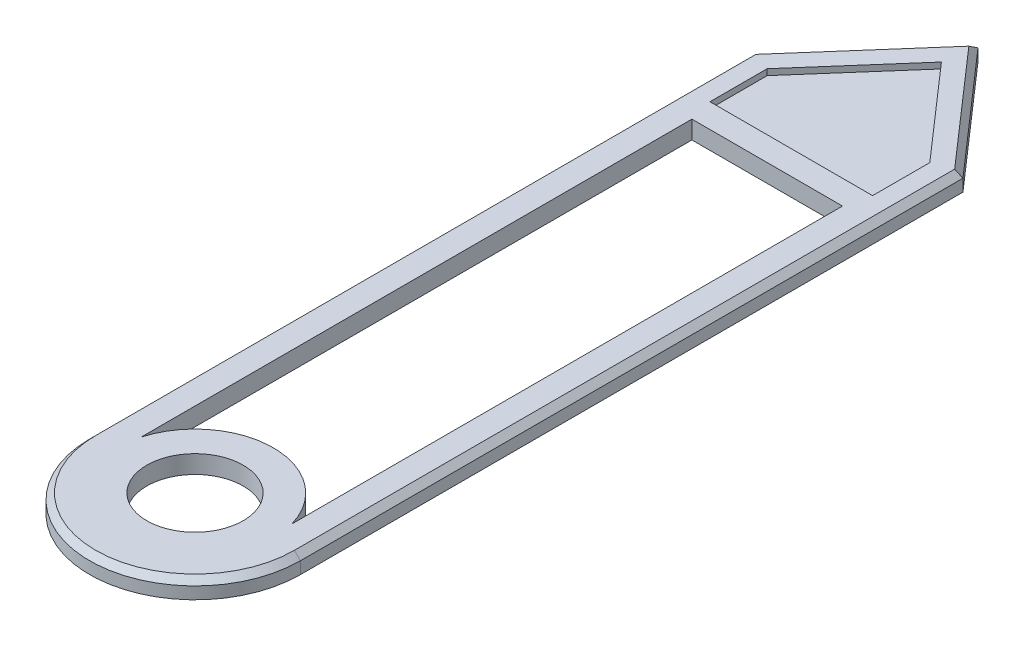
ISO-10303-21;
HEADER;
FILE_DESCRIPTION(('STEP AP214'),'2;1');
FILE_NAME('part.step','',(''),(''),'','','');
FILE_SCHEMA(('AUTOMOTIVE_DESIGN { 1 0 10303 214 1 1 1 1 }'));
ENDSEC;
DATA;
#1=APPLICATION_CONTEXT('core data for automotive mechanical design processes');
#2=APPLICATION_PROTOCOL_DEFINITION('international standard','automotive_design',2000,#1);
#3=PRODUCT_CONTEXT('',#1,'mechanical');
#4=PRODUCT('Part','Part','',(#3));
#5=PRODUCT_RELATED_PRODUCT_CATEGORY('part','',(#4));
#6=PRODUCT_DEFINITION_FORMATION('','',#4);
#7=PRODUCT_DEFINITION_CONTEXT('part definition',#1,'design');
#8=PRODUCT_DEFINITION('design','',#6,#7);
#9=PRODUCT_DEFINITION_SHAPE('','',#8);
#10=(LENGTH_UNIT() NAMED_UNIT(*) SI_UNIT(.MILLI.,.METRE.));
#11=(NAMED_UNIT(*) PLANE_ANGLE_UNIT() SI_UNIT($,.RADIAN.));
#12=(NAMED_UNIT(*) SI_UNIT($,.STERADIAN.) SOLID_ANGLE_UNIT());
#13=UNCERTAINTY_MEASURE_WITH_UNIT(LENGTH_MEASURE(1.E-05),#10,'distance_accuracy_value','');
#14=(GEOMETRIC_REPRESENTATION_CONTEXT(3) GLOBAL_UNCERTAINTY_ASSIGNED_CONTEXT((#13)) GLOBAL_UNIT_ASSIGNED_CONTEXT((#10,
#11,#12)) REPRESENTATION_CONTEXT('',''));
#15=CARTESIAN_POINT('',(0.,0.,0.));
#16=DIRECTION('',(0.,0.,1.));
#17=DIRECTION('',(1.,0.,0.));
#18=AXIS2_PLACEMENT_3D('',#15,#16,#17);
#19=CARTESIAN_POINT('',(0.,0.3,0.));
#20=DIRECTION('',(0.,1.,0.));
#21=DIRECTION('',(0.,0.,1.));
#22=AXIS2_PLACEMENT_3D('',#19,#20,#21);
#23=PLANE('',#22);
#24=DIRECTION('',(-0.658504607868518,0.,0.752576694706878));
#25=VECTOR('',#24,1.);
#26=CARTESIAN_POINT('',(-1.67474233052931,0.3,-10.9341495392131));
#27=LINE('',#26,#25);
#28=CARTESIAN_POINT('',(0.,0.3,-12.8481407741038));
#29=VERTEX_POINT('',#28);
#30=CARTESIAN_POINT('',(-1.65,0.3,-10.9624264883895));
#31=VERTEX_POINT('',#30);
#32=EDGE_CURVE('E346',#29,#31,#27,.T.);
#33=ORIENTED_EDGE('',*,*,#32,.T.);
#34=DIRECTION('',(0.,0.,1.));
#35=VECTOR('',#34,1.);
#36=CARTESIAN_POINT('',(-1.65,0.3,0.));
#37=LINE('',#36,#35);
#38=CARTESIAN_POINT('',(-1.65,0.3,0.));
#39=VERTEX_POINT('',#38);
#40=EDGE_CURVE('E352',#31,#39,#37,.T.);
#41=ORIENTED_EDGE('',*,*,#40,.T.);
#42=CARTESIAN_POINT('',(0.,0.3,0.));
#43=DIRECTION('',(0.,1.,0.));
#44=DIRECTION('',(0.,0.,1.));
#45=AXIS2_PLACEMENT_3D('',#42,#43,#44);
#46=CIRCLE('',#45,1.65);
#47=CARTESIAN_POINT('',(1.65,0.3,0.));
#48=VERTEX_POINT('',#47);
#49=EDGE_CURVE('E349',#39,#48,#46,.T.);
#50=ORIENTED_EDGE('',*,*,#49,.T.);
#51=DIRECTION('',(0.,0.,-1.));
#52=VECTOR('',#51,1.);
#53=CARTESIAN_POINT('',(1.65,0.3,-11.));
#54=LINE('',#53,#52);
#55=CARTESIAN_POINT('',(1.65,0.3,-10.9624264883895));
#56=VERTEX_POINT('',#55);
#57=EDGE_CURVE('E340',#48,#56,#54,.T.);
#58=ORIENTED_EDGE('',*,*,#57,.T.);
#59=DIRECTION('',(-0.658504607868518,0.,-0.752576694706878));
#60=VECTOR('',#59,1.);
#61=CARTESIAN_POINT('',(-0.0752576694706887,0.3,-12.9341495392131));
#62=LINE('',#61,#60);
#63=EDGE_CURVE('E343',#56,#29,#62,.T.);
#64=ORIENTED_EDGE('',*,*,#63,.T.);
#65=EDGE_LOOP('',(#33,#41,#50,#58,#64));
#66=FACE_BOUND('',#65,.T.);
#67=DIRECTION('',(0.,0.,-1.));
#68=VECTOR('',#67,1.);
#69=CARTESIAN_POINT('',(1.35,0.3,-9.9));
#70=LINE('',#69,#68);
#71=CARTESIAN_POINT('',(1.35,0.3,-9.9));
#72=VERTEX_POINT('',#71);
#73=CARTESIAN_POINT('',(1.35,0.3,-10.849705953558));
#74=VERTEX_POINT('',#73);
#75=EDGE_CURVE('E196',#72,#74,#70,.T.);
#76=ORIENTED_EDGE('',*,*,#75,.F.);
#77=DIRECTION('',(1.,0.,0.));
#78=VECTOR('',#77,1.);
#79=CARTESIAN_POINT('',(-1.35,0.3,-9.9));
#80=LINE('',#79,#78);
#81=CARTESIAN_POINT('',(-1.35,0.3,-9.9));
#82=VERTEX_POINT('',#81);
#83=EDGE_CURVE('E217',#82,#72,#80,.T.);
#84=ORIENTED_EDGE('',*,*,#83,.F.);
#85=DIRECTION('',(0.,0.,1.));
#86=VECTOR('',#85,1.);
#87=CARTESIAN_POINT('',(-1.35,0.3,-10.849705953558));
#88=LINE('',#87,#86);
#89=CARTESIAN_POINT('',(-1.35,0.3,-10.849705953558));
#90=VERTEX_POINT('',#89);
#91=EDGE_CURVE('E223',#90,#82,#88,.T.);
#92=ORIENTED_EDGE('',*,*,#91,.F.);
#93=DIRECTION('',(-0.658504607868518,0.,0.752576694706878));
#94=VECTOR('',#93,1.);
#95=CARTESIAN_POINT('',(0.,0.3,-12.3925630964152));
#96=LINE('',#95,#94);
#97=CARTESIAN_POINT('',(0.,0.3,-12.3925630964152));
#98=VERTEX_POINT('',#97);
#99=EDGE_CURVE('E238',#98,#90,#96,.T.);
#100=ORIENTED_EDGE('',*,*,#99,.F.);
#101=DIRECTION('',(-0.658504607868518,0.,-0.752576694706878));
#102=VECTOR('',#101,1.);
#103=CARTESIAN_POINT('',(1.35,0.3,-10.849705953558));
#104=LINE('',#103,#102);
#105=EDGE_CURVE('E235',#74,#98,#104,.T.);
#106=ORIENTED_EDGE('',*,*,#105,.F.);
#107=EDGE_LOOP('',(#76,#84,#92,#100,#106));
#108=FACE_BOUND('',#107,.T.);
#109=CARTESIAN_POINT('',(0.,0.3,0.));
#110=DIRECTION('',(0.,1.,0.));
#111=DIRECTION('',(0.,0.,1.));
#112=AXIS2_PLACEMENT_3D('',#109,#110,#111);
#113=CIRCLE('',#112,0.8);
#114=CARTESIAN_POINT('',(0.,0.3,0.8));
#115=VERTEX_POINT('',#114);
#116=EDGE_CURVE('E298',#115,#115,#113,.T.);
#117=ORIENTED_EDGE('',*,*,#116,.F.);
#118=EDGE_LOOP('',(#117));
#119=FACE_BOUND('',#118,.T.);
#120=DIRECTION('',(0.,0.,-1.));
#121=VECTOR('',#120,1.);
#122=CARTESIAN_POINT('',(1.25,0.3,-9.5));
#123=LINE('',#122,#121);
#124=CARTESIAN_POINT('',(1.25,0.3,-0.357071421427142));
#125=VERTEX_POINT('',#124);
#126=CARTESIAN_POINT('',(1.25,0.3,-9.5));
#127=VERTEX_POINT('',#126);
#128=EDGE_CURVE('E259',#125,#127,#123,.T.);
#129=ORIENTED_EDGE('',*,*,#128,.F.);
#130=CARTESIAN_POINT('',(0.,0.3,0.));
#131=DIRECTION('',(0.,-1.,0.));
#132=DIRECTION('',(0.,0.,-1.));
#133=AXIS2_PLACEMENT_3D('',#130,#131,#132);
#134=CIRCLE('',#133,1.3);
#135=CARTESIAN_POINT('',(-1.25,0.3,-0.357071421427142));
#136=VERTEX_POINT('',#135);
#137=EDGE_CURVE('E256',#136,#125,#134,.T.);
#138=ORIENTED_EDGE('',*,*,#137,.F.);
#139=DIRECTION('',(0.,0.,1.));
#140=VECTOR('',#139,1.);
#141=CARTESIAN_POINT('',(-1.25,0.3,-0.357071421427142));
#142=LINE('',#141,#140);
#143=CARTESIAN_POINT('',(-1.25,0.3,-9.5));
#144=VERTEX_POINT('',#143);
#145=EDGE_CURVE('E267',#144,#136,#142,.T.);
#146=ORIENTED_EDGE('',*,*,#145,.F.);
#147=DIRECTION('',(-1.,0.,0.));
#148=VECTOR('',#147,1.);
#149=CARTESIAN_POINT('',(-1.25,0.3,-9.5));
#150=LINE('',#149,#148);
#151=EDGE_CURVE('E263',#127,#144,#150,.T.);
#152=ORIENTED_EDGE('',*,*,#151,.F.);
#153=EDGE_LOOP('',(#129,#138,#146,#152));
#154=FACE_BOUND('',#153,.T.);
#155=ADVANCED_FACE('F38',(#66,#108,#119,#154),#23,.T.);
#156=CARTESIAN_POINT('',(0.,0.,0.));
#157=DIRECTION('',(0.,1.,0.));
#158=DIRECTION('',(0.,0.,1.));
#159=AXIS2_PLACEMENT_3D('',#156,#157,#158);
#160=PLANE('',#159);
#161=CARTESIAN_POINT('',(0.,0.,0.));
#162=DIRECTION('',(0.,1.,0.));
#163=DIRECTION('',(0.,0.,1.));
#164=AXIS2_PLACEMENT_3D('',#161,#162,#163);
#165=CIRCLE('',#164,0.8);
#166=CARTESIAN_POINT('',(0.,0.,0.8));
#167=VERTEX_POINT('',#166);
#168=EDGE_CURVE('E297',#167,#167,#165,.T.);
#169=ORIENTED_EDGE('',*,*,#168,.T.);
#170=EDGE_LOOP('',(#169));
#171=FACE_BOUND('',#170,.T.);
#172=CARTESIAN_POINT('',(0.,0.,0.));
#173=DIRECTION('',(0.,1.,0.));
#174=DIRECTION('',(0.,0.,1.));
#175=AXIS2_PLACEMENT_3D('',#172,#173,#174);
#176=CIRCLE('',#175,1.75);
#177=CARTESIAN_POINT('',(-1.75,0.,0.));
#178=VERTEX_POINT('',#177);
#179=CARTESIAN_POINT('',(1.75,0.,0.));
#180=VERTEX_POINT('',#179);
#181=EDGE_CURVE('E302',#178,#180,#176,.T.);
#182=ORIENTED_EDGE('',*,*,#181,.F.);
#183=DIRECTION('',(0.,0.,1.));
#184=VECTOR('',#183,1.);
#185=CARTESIAN_POINT('',(-1.75,0.,0.));
#186=LINE('',#185,#184);
#187=CARTESIAN_POINT('',(-1.75,0.,-11.));
#188=VERTEX_POINT('',#187);
#189=EDGE_CURVE('E321',#188,#178,#186,.T.);
#190=ORIENTED_EDGE('',*,*,#189,.F.);
#191=DIRECTION('',(-0.658504607868518,0.,0.752576694706878));
#192=VECTOR('',#191,1.);
#193=CARTESIAN_POINT('',(-1.75,0.,-11.));
#194=LINE('',#193,#192);
#195=CARTESIAN_POINT('',(0.,0.,-13.));
#196=VERTEX_POINT('',#195);
#197=EDGE_CURVE('E317',#196,#188,#194,.T.);
#198=ORIENTED_EDGE('',*,*,#197,.F.);
#199=DIRECTION('',(-0.658504607868518,0.,-0.752576694706878));
#200=VECTOR('',#199,1.);
#201=CARTESIAN_POINT('',(0.,0.,-13.));
#202=LINE('',#201,#200);
#203=CARTESIAN_POINT('',(1.75,0.,-11.));
#204=VERTEX_POINT('',#203);
#205=EDGE_CURVE('E313',#204,#196,#202,.T.);
#206=ORIENTED_EDGE('',*,*,#205,.F.);
#207=DIRECTION('',(0.,0.,-1.));
#208=VECTOR('',#207,1.);
#209=CARTESIAN_POINT('',(1.75,0.,0.));
#210=LINE('',#209,#208);
#211=EDGE_CURVE('E309',#180,#204,#210,.T.);
#212=ORIENTED_EDGE('',*,*,#211,.F.);
#213=EDGE_LOOP('',(#182,#190,#198,#206,#212));
#214=FACE_BOUND('',#213,.T.);
#215=CARTESIAN_POINT('',(0.,0.,0.));
#216=DIRECTION('',(0.,-1.,0.));
#217=DIRECTION('',(0.,0.,-1.));
#218=AXIS2_PLACEMENT_3D('',#215,#216,#217);
#219=CIRCLE('',#218,1.3);
#220=CARTESIAN_POINT('',(-1.25,0.,-0.357071421427142));
#221=VERTEX_POINT('',#220);
#222=CARTESIAN_POINT('',(1.25,0.,-0.357071421427142));
#223=VERTEX_POINT('',#222);
#224=EDGE_CURVE('E247',#221,#223,#219,.T.);
#225=ORIENTED_EDGE('',*,*,#224,.T.);
#226=DIRECTION('',(0.,0.,-1.));
#227=VECTOR('',#226,1.);
#228=CARTESIAN_POINT('',(1.25,0.,-9.5));
#229=LINE('',#228,#227);
#230=CARTESIAN_POINT('',(1.25,0.,-9.5));
#231=VERTEX_POINT('',#230);
#232=EDGE_CURVE('E274',#223,#231,#229,.T.);
#233=ORIENTED_EDGE('',*,*,#232,.T.);
#234=DIRECTION('',(-1.,0.,0.));
#235=VECTOR('',#234,1.);
#236=CARTESIAN_POINT('',(-1.25,0.,-9.5));
#237=LINE('',#236,#235);
#238=CARTESIAN_POINT('',(-1.25,0.,-9.5));
#239=VERTEX_POINT('',#238);
#240=EDGE_CURVE('E278',#231,#239,#237,.T.);
#241=ORIENTED_EDGE('',*,*,#240,.T.);
#242=DIRECTION('',(0.,0.,1.));
#243=VECTOR('',#242,1.);
#244=CARTESIAN_POINT('',(-1.25,0.,-0.357071421427142));
#245=LINE('',#244,#243);
#246=EDGE_CURVE('E260',#239,#221,#245,.T.);
#247=ORIENTED_EDGE('',*,*,#246,.T.);
#248=EDGE_LOOP('',(#225,#233,#241,#247));
#249=FACE_BOUND('',#248,.T.);
#250=ADVANCED_FACE('F421',(#171,#214,#249),#160,.F.);
#251=CARTESIAN_POINT('',(0.,0.3,0.));
#252=DIRECTION('',(0.,-1.,0.));
#253=DIRECTION('',(0.,0.,-1.));
#254=AXIS2_PLACEMENT_3D('',#251,#252,#253);
#255=CYLINDRICAL_SURFACE('',#254,1.75);
#256=DIRECTION('',(0.,-1.,0.));
#257=VECTOR('',#256,1.);
#258=CARTESIAN_POINT('',(1.75,0.3,0.));
#259=LINE('',#258,#257);
#260=CARTESIAN_POINT('',(1.75,0.200000000000001,0.));
#261=VERTEX_POINT('',#260);
#262=EDGE_CURVE('E337',#261,#180,#259,.T.);
#263=ORIENTED_EDGE('',*,*,#262,.F.);
#264=CARTESIAN_POINT('',(0.,0.200000000000001,0.));
#265=DIRECTION('',(0.,1.,0.));
#266=DIRECTION('',(0.,0.,1.));
#267=AXIS2_PLACEMENT_3D('',#264,#265,#266);
#268=CIRCLE('',#267,1.75);
#269=CARTESIAN_POINT('',(-1.75,0.200000000000001,0.));
#270=VERTEX_POINT('',#269);
#271=EDGE_CURVE('E360',#261,#270,#268,.F.);
#272=ORIENTED_EDGE('',*,*,#271,.T.);
#273=DIRECTION('',(0.,-1.,0.));
#274=VECTOR('',#273,1.);
#275=CARTESIAN_POINT('',(-1.75,0.3,0.));
#276=LINE('',#275,#274);
#277=EDGE_CURVE('E325',#270,#178,#276,.T.);
#278=ORIENTED_EDGE('',*,*,#277,.T.);
#279=ORIENTED_EDGE('',*,*,#181,.T.);
#280=EDGE_LOOP('',(#263,#272,#278,#279));
#281=FACE_BOUND('',#280,.T.);
#282=ADVANCED_FACE('F404',(#281),#255,.T.);
#283=CARTESIAN_POINT('',(1.75,0.3,0.));
#284=DIRECTION('',(-1.,0.,0.));
#285=DIRECTION('',(0.,0.,1.));
#286=AXIS2_PLACEMENT_3D('',#283,#284,#285);
#287=PLANE('',#286);
#288=DIRECTION('',(0.,-1.,0.));
#289=VECTOR('',#288,1.);
#290=CARTESIAN_POINT('',(1.75,0.3,-11.));
#291=LINE('',#290,#289);
#292=CARTESIAN_POINT('',(1.75,0.200000000000001,-11.));
#293=VERTEX_POINT('',#292);
#294=EDGE_CURVE('E334',#293,#204,#291,.T.);
#295=ORIENTED_EDGE('',*,*,#294,.F.);
#296=DIRECTION('',(0.,0.,1.));
#297=VECTOR('',#296,1.);
#298=CARTESIAN_POINT('',(1.75,0.200000000000001,0.));
#299=LINE('',#298,#297);
#300=EDGE_CURVE('E11',#293,#261,#299,.T.);
#301=ORIENTED_EDGE('',*,*,#300,.T.);
#302=ORIENTED_EDGE('',*,*,#262,.T.);
#303=ORIENTED_EDGE('',*,*,#211,.T.);
#304=EDGE_LOOP('',(#295,#301,#302,#303));
#305=FACE_BOUND('',#304,.T.);
#306=ADVANCED_FACE('F440',(#305),#287,.F.);
#307=CARTESIAN_POINT('',(0.,0.3,-13.));
#308=DIRECTION('',(-0.752576694706878,0.,0.658504607868518));
#309=DIRECTION('',(0.658504607868518,0.,0.752576694706878));
#310=AXIS2_PLACEMENT_3D('',#307,#308,#309);
#311=PLANE('',#310);
#312=DIRECTION('',(0.,-1.,0.));
#313=VECTOR('',#312,1.);
#314=CARTESIAN_POINT('',(0.,0.3,-13.));
#315=LINE('',#314,#313);
#316=CARTESIAN_POINT('',(0.,0.200000000000001,-13.));
#317=VERTEX_POINT('',#316);
#318=EDGE_CURVE('E331',#317,#196,#315,.T.);
#319=ORIENTED_EDGE('',*,*,#318,.F.);
#320=DIRECTION('',(0.658504607868518,0.,0.752576694706878));
#321=VECTOR('',#320,1.);
#322=CARTESIAN_POINT('',(1.75,0.2,-11.));
#323=LINE('',#322,#321);
#324=EDGE_CURVE('E48',#317,#293,#323,.T.);
#325=ORIENTED_EDGE('',*,*,#324,.T.);
#326=ORIENTED_EDGE('',*,*,#294,.T.);
#327=ORIENTED_EDGE('',*,*,#205,.T.);
#328=EDGE_LOOP('',(#319,#325,#326,#327));
#329=FACE_BOUND('',#328,.T.);
#330=ADVANCED_FACE('F437',(#329),#311,.F.);
#331=CARTESIAN_POINT('',(-1.75,0.3,-11.));
#332=DIRECTION('',(0.752576694706878,0.,0.658504607868518));
#333=DIRECTION('',(0.658504607868518,0.,-0.752576694706878));
#334=AXIS2_PLACEMENT_3D('',#331,#332,#333);
#335=PLANE('',#334);
#336=DIRECTION('',(0.,-1.,0.));
#337=VECTOR('',#336,1.);
#338=CARTESIAN_POINT('',(-1.75,0.3,-11.));
#339=LINE('',#338,#337);
#340=CARTESIAN_POINT('',(-1.75,0.200000000000001,-11.));
#341=VERTEX_POINT('',#340);
#342=EDGE_CURVE('E328',#341,#188,#339,.T.);
#343=ORIENTED_EDGE('',*,*,#342,.F.);
#344=DIRECTION('',(0.658504607868518,0.,-0.752576694706878));
#345=VECTOR('',#344,1.);
#346=CARTESIAN_POINT('',(0.,0.2,-13.));
#347=LINE('',#346,#345);
#348=EDGE_CURVE('E68',#341,#317,#347,.T.);
#349=ORIENTED_EDGE('',*,*,#348,.T.);
#350=ORIENTED_EDGE('',*,*,#318,.T.);
#351=ORIENTED_EDGE('',*,*,#197,.T.);
#352=EDGE_LOOP('',(#343,#349,#350,#351));
#353=FACE_BOUND('',#352,.T.);
#354=ADVANCED_FACE('F434',(#353),#335,.F.);
#355=CARTESIAN_POINT('',(-1.75,0.3,0.));
#356=DIRECTION('',(1.,0.,0.));
#357=DIRECTION('',(0.,0.,-1.));
#358=AXIS2_PLACEMENT_3D('',#355,#356,#357);
#359=PLANE('',#358);
#360=ORIENTED_EDGE('',*,*,#277,.F.);
#361=DIRECTION('',(0.,0.,-1.));
#362=VECTOR('',#361,1.);
#363=CARTESIAN_POINT('',(-1.75,0.200000000000001,-11.));
#364=LINE('',#363,#362);
#365=EDGE_CURVE('E356',#270,#341,#364,.T.);
#366=ORIENTED_EDGE('',*,*,#365,.T.);
#367=ORIENTED_EDGE('',*,*,#342,.T.);
#368=ORIENTED_EDGE('',*,*,#189,.T.);
#369=EDGE_LOOP('',(#360,#366,#367,#368));
#370=FACE_BOUND('',#369,.T.);
#371=ADVANCED_FACE('F407',(#370),#359,.F.);
#372=CARTESIAN_POINT('',(0.,0.3,0.));
#373=DIRECTION('',(0.,-1.,0.));
#374=DIRECTION('',(0.,0.,-1.));
#375=AXIS2_PLACEMENT_3D('',#372,#373,#374);
#376=CYLINDRICAL_SURFACE('',#375,0.8);
#377=ORIENTED_EDGE('',*,*,#116,.T.);
#378=EDGE_LOOP('',(#377));
#379=FACE_BOUND('',#378,.T.);
#380=ORIENTED_EDGE('',*,*,#168,.F.);
#381=EDGE_LOOP('',(#380));
#382=FACE_BOUND('',#381,.T.);
#383=ADVANCED_FACE('F429',(#379,#382),#376,.F.);
#384=CARTESIAN_POINT('',(0.,0.3,0.));
#385=DIRECTION('',(0.,-1.,0.));
#386=DIRECTION('',(0.,0.,-1.));
#387=AXIS2_PLACEMENT_3D('',#384,#385,#386);
#388=CYLINDRICAL_SURFACE('',#387,1.3);
#389=ORIENTED_EDGE('',*,*,#224,.F.);
#390=DIRECTION('',(0.,-1.,0.));
#391=VECTOR('',#390,1.);
#392=CARTESIAN_POINT('',(-1.25,0.3,-0.357071421427142));
#393=LINE('',#392,#391);
#394=EDGE_CURVE('E270',#136,#221,#393,.T.);
#395=ORIENTED_EDGE('',*,*,#394,.F.);
#396=ORIENTED_EDGE('',*,*,#137,.T.);
#397=DIRECTION('',(0.,-1.,0.));
#398=VECTOR('',#397,1.);
#399=CARTESIAN_POINT('',(1.25,0.3,-0.357071421427142));
#400=LINE('',#399,#398);
#401=EDGE_CURVE('E293',#125,#223,#400,.T.);
#402=ORIENTED_EDGE('',*,*,#401,.T.);
#403=EDGE_LOOP('',(#389,#395,#396,#402));
#404=FACE_BOUND('',#403,.T.);
#405=ADVANCED_FACE('F579',(#404),#388,.T.);
#406=CARTESIAN_POINT('',(1.25,0.3,-9.5));
#407=DIRECTION('',(-1.,0.,0.));
#408=DIRECTION('',(0.,0.,1.));
#409=AXIS2_PLACEMENT_3D('',#406,#407,#408);
#410=PLANE('',#409);
#411=ORIENTED_EDGE('',*,*,#232,.F.);
#412=ORIENTED_EDGE('',*,*,#401,.F.);
#413=ORIENTED_EDGE('',*,*,#128,.T.);
#414=DIRECTION('',(0.,-1.,0.));
#415=VECTOR('',#414,1.);
#416=CARTESIAN_POINT('',(1.25,0.3,-9.5));
#417=LINE('',#416,#415);
#418=EDGE_CURVE('E291',#127,#231,#417,.T.);
#419=ORIENTED_EDGE('',*,*,#418,.T.);
#420=EDGE_LOOP('',(#411,#412,#413,#419));
#421=FACE_BOUND('',#420,.T.);
#422=ADVANCED_FACE('F571',(#421),#410,.T.);
#423=CARTESIAN_POINT('',(-1.25,0.3,-9.5));
#424=DIRECTION('',(0.,0.,1.));
#425=DIRECTION('',(1.,0.,0.));
#426=AXIS2_PLACEMENT_3D('',#423,#424,#425);
#427=PLANE('',#426);
#428=ORIENTED_EDGE('',*,*,#240,.F.);
#429=ORIENTED_EDGE('',*,*,#418,.F.);
#430=ORIENTED_EDGE('',*,*,#151,.T.);
#431=DIRECTION('',(0.,-1.,0.));
#432=VECTOR('',#431,1.);
#433=CARTESIAN_POINT('',(-1.25,0.3,-9.5));
#434=LINE('',#433,#432);
#435=EDGE_CURVE('E288',#144,#239,#434,.T.);
#436=ORIENTED_EDGE('',*,*,#435,.T.);
#437=EDGE_LOOP('',(#428,#429,#430,#436));
#438=FACE_BOUND('',#437,.T.);
#439=ADVANCED_FACE('F564',(#438),#427,.T.);
#440=CARTESIAN_POINT('',(-1.25,0.3,-0.357071421427142));
#441=DIRECTION('',(1.,0.,0.));
#442=DIRECTION('',(0.,0.,-1.));
#443=AXIS2_PLACEMENT_3D('',#440,#441,#442);
#444=PLANE('',#443);
#445=ORIENTED_EDGE('',*,*,#246,.F.);
#446=ORIENTED_EDGE('',*,*,#435,.F.);
#447=ORIENTED_EDGE('',*,*,#145,.T.);
#448=ORIENTED_EDGE('',*,*,#394,.T.);
#449=EDGE_LOOP('',(#445,#446,#447,#448));
#450=FACE_BOUND('',#449,.T.);
#451=ADVANCED_FACE('F557',(#450),#444,.T.);
#452=CARTESIAN_POINT('',(1.35,0.2,-9.9));
#453=DIRECTION('',(1.,0.,0.));
#454=DIRECTION('',(0.,0.,-1.));
#455=AXIS2_PLACEMENT_3D('',#452,#453,#454);
#456=PLANE('',#455);
#457=ORIENTED_EDGE('',*,*,#75,.T.);
#458=DIRECTION('',(0.,1.,0.));
#459=VECTOR('',#458,1.);
#460=CARTESIAN_POINT('',(1.35,0.2,-10.849705953558));
#461=LINE('',#460,#459);
#462=CARTESIAN_POINT('',(1.35,0.2,-10.849705953558));
#463=VERTEX_POINT('',#462);
#464=EDGE_CURVE('E189',#463,#74,#461,.T.);
#465=ORIENTED_EDGE('',*,*,#464,.F.);
#466=DIRECTION('',(0.,0.,-1.));
#467=VECTOR('',#466,1.);
#468=CARTESIAN_POINT('',(1.35,0.2,-9.9));
#469=LINE('',#468,#467);
#470=CARTESIAN_POINT('',(1.35,0.2,-9.9));
#471=VERTEX_POINT('',#470);
#472=EDGE_CURVE('E193',#471,#463,#469,.T.);
#473=ORIENTED_EDGE('',*,*,#472,.F.);
#474=DIRECTION('',(0.,1.,0.));
#475=VECTOR('',#474,1.);
#476=CARTESIAN_POINT('',(1.35,0.2,-9.9));
#477=LINE('',#476,#475);
#478=EDGE_CURVE('E245',#471,#72,#477,.T.);
#479=ORIENTED_EDGE('',*,*,#478,.T.);
#480=EDGE_LOOP('',(#457,#465,#473,#479));
#481=FACE_BOUND('',#480,.T.);
#482=ADVANCED_FACE('F191',(#481),#456,.F.);
#483=CARTESIAN_POINT('',(-1.35,0.2,-9.9));
#484=DIRECTION('',(0.,0.,1.));
#485=DIRECTION('',(1.,0.,0.));
#486=AXIS2_PLACEMENT_3D('',#483,#484,#485);
#487=PLANE('',#486);
#488=ORIENTED_EDGE('',*,*,#83,.T.);
#489=ORIENTED_EDGE('',*,*,#478,.F.);
#490=DIRECTION('',(1.,0.,0.));
#491=VECTOR('',#490,1.);
#492=CARTESIAN_POINT('',(-1.35,0.2,-9.9));
#493=LINE('',#492,#491);
#494=CARTESIAN_POINT('',(-1.35,0.2,-9.9));
#495=VERTEX_POINT('',#494);
#496=EDGE_CURVE('E202',#495,#471,#493,.T.);
#497=ORIENTED_EDGE('',*,*,#496,.F.);
#498=DIRECTION('',(0.,1.,0.));
#499=VECTOR('',#498,1.);
#500=CARTESIAN_POINT('',(-1.35,0.2,-9.9));
#501=LINE('',#500,#499);
#502=EDGE_CURVE('E248',#495,#82,#501,.T.);
#503=ORIENTED_EDGE('',*,*,#502,.T.);
#504=EDGE_LOOP('',(#488,#489,#497,#503));
#505=FACE_BOUND('',#504,.T.);
#506=ADVANCED_FACE('F542',(#505),#487,.F.);
#507=CARTESIAN_POINT('',(-1.35,0.2,-10.849705953558));
#508=DIRECTION('',(-1.,0.,0.));
#509=DIRECTION('',(0.,0.,1.));
#510=AXIS2_PLACEMENT_3D('',#507,#508,#509);
#511=PLANE('',#510);
#512=ORIENTED_EDGE('',*,*,#91,.T.);
#513=ORIENTED_EDGE('',*,*,#502,.F.);
#514=DIRECTION('',(0.,0.,1.));
#515=VECTOR('',#514,1.);
#516=CARTESIAN_POINT('',(-1.35,0.2,-10.849705953558));
#517=LINE('',#516,#515);
#518=CARTESIAN_POINT('',(-1.35,0.2,-10.849705953558));
#519=VERTEX_POINT('',#518);
#520=EDGE_CURVE('E228',#519,#495,#517,.T.);
#521=ORIENTED_EDGE('',*,*,#520,.F.);
#522=DIRECTION('',(0.,1.,0.));
#523=VECTOR('',#522,1.);
#524=CARTESIAN_POINT('',(-1.35,0.2,-10.849705953558));
#525=LINE('',#524,#523);
#526=EDGE_CURVE('E251',#519,#90,#525,.T.);
#527=ORIENTED_EDGE('',*,*,#526,.T.);
#528=EDGE_LOOP('',(#512,#513,#521,#527));
#529=FACE_BOUND('',#528,.T.);
#530=ADVANCED_FACE('F534',(#529),#511,.F.);
#531=CARTESIAN_POINT('',(0.,0.2,-12.3925630964152));
#532=DIRECTION('',(-0.752576694706878,0.,-0.658504607868518));
#533=DIRECTION('',(-0.658504607868518,0.,0.752576694706878));
#534=AXIS2_PLACEMENT_3D('',#531,#532,#533);
#535=PLANE('',#534);
#536=ORIENTED_EDGE('',*,*,#99,.T.);
#537=ORIENTED_EDGE('',*,*,#526,.F.);
#538=DIRECTION('',(-0.658504607868518,0.,0.752576694706878));
#539=VECTOR('',#538,1.);
#540=CARTESIAN_POINT('',(0.,0.2,-12.3925630964152));
#541=LINE('',#540,#539);
#542=CARTESIAN_POINT('',(0.,0.2,-12.3925630964152));
#543=VERTEX_POINT('',#542);
#544=EDGE_CURVE('E211',#543,#519,#541,.T.);
#545=ORIENTED_EDGE('',*,*,#544,.F.);
#546=DIRECTION('',(0.,1.,0.));
#547=VECTOR('',#546,1.);
#548=CARTESIAN_POINT('',(0.,0.2,-12.3925630964152));
#549=LINE('',#548,#547);
#550=EDGE_CURVE('E201',#543,#98,#549,.T.);
#551=ORIENTED_EDGE('',*,*,#550,.T.);
#552=EDGE_LOOP('',(#536,#537,#545,#551));
#553=FACE_BOUND('',#552,.T.);
#554=ADVANCED_FACE('F527',(#553),#535,.F.);
#555=CARTESIAN_POINT('',(1.35,0.2,-10.849705953558));
#556=DIRECTION('',(0.752576694706878,0.,-0.658504607868518));
#557=DIRECTION('',(-0.658504607868518,0.,-0.752576694706878));
#558=AXIS2_PLACEMENT_3D('',#555,#556,#557);
#559=PLANE('',#558);
#560=ORIENTED_EDGE('',*,*,#105,.T.);
#561=ORIENTED_EDGE('',*,*,#550,.F.);
#562=DIRECTION('',(-0.658504607868518,0.,-0.752576694706878));
#563=VECTOR('',#562,1.);
#564=CARTESIAN_POINT('',(1.35,0.2,-10.849705953558));
#565=LINE('',#564,#563);
#566=EDGE_CURVE('E205',#463,#543,#565,.T.);
#567=ORIENTED_EDGE('',*,*,#566,.F.);
#568=ORIENTED_EDGE('',*,*,#464,.T.);
#569=EDGE_LOOP('',(#560,#561,#567,#568));
#570=FACE_BOUND('',#569,.T.);
#571=ADVANCED_FACE('F206',(#570),#559,.F.);
#572=CARTESIAN_POINT('',(0.,0.2,0.));
#573=DIRECTION('',(0.,-1.,0.));
#574=DIRECTION('',(0.,0.,-1.));
#575=AXIS2_PLACEMENT_3D('',#572,#573,#574);
#576=PLANE('',#575);
#577=ORIENTED_EDGE('',*,*,#472,.T.);
#578=ORIENTED_EDGE('',*,*,#566,.T.);
#579=ORIENTED_EDGE('',*,*,#544,.T.);
#580=ORIENTED_EDGE('',*,*,#520,.T.);
#581=ORIENTED_EDGE('',*,*,#496,.T.);
#582=EDGE_LOOP('',(#577,#578,#579,#580,#581));
#583=FACE_BOUND('',#582,.T.);
#584=ADVANCED_FACE('F213',(#583),#576,.F.);
#585=CARTESIAN_POINT('',(6.36722020663551,0.3,-5.57131768080607));
#586=DIRECTION('',(0.532152084190189,0.707106781186551,-0.465633073666415));
#587=DIRECTION('',(0.658504607868518,0.,0.752576694706878));
#588=AXIS2_PLACEMENT_3D('',#585,#586,#587);
#589=PLANE('',#588);
#590=DIRECTION('',(0.,0.54997194092287,0.835183132131828));
#591=VECTOR('',#590,1.);
#592=CARTESIAN_POINT('',(0.,3.64244341818891,-7.77233207322331));
#593=LINE('',#592,#591);
#594=EDGE_CURVE('E376',#29,#317,#593,.F.);
#595=ORIENTED_EDGE('',*,*,#594,.F.);
#596=ORIENTED_EDGE('',*,*,#63,.F.);
#597=DIRECTION('',(-0.683398037956692,0.683398037956692,0.256776641137562));
#598=VECTOR('',#597,1.);
#599=CARTESIAN_POINT('',(-0.273693755868321,2.22369375586832,-10.2396271916779));
#600=LINE('',#599,#598);
#601=EDGE_CURVE('E42',#293,#56,#600,.T.);
#602=ORIENTED_EDGE('',*,*,#601,.F.);
#603=ORIENTED_EDGE('',*,*,#324,.F.);
#604=EDGE_LOOP('',(#595,#596,#602,#603));
#605=FACE_BOUND('',#604,.T.);
#606=ADVANCED_FACE('F40',(#605),#589,.T.);
#607=CARTESIAN_POINT('',(1.65,0.3,0.));
#608=DIRECTION('',(0.707106781186548,0.707106781186548,0.));
#609=DIRECTION('',(0.,0.,1.));
#610=AXIS2_PLACEMENT_3D('',#607,#608,#609);
#611=PLANE('',#610);
#612=ORIENTED_EDGE('',*,*,#601,.T.);
#613=ORIENTED_EDGE('',*,*,#57,.F.);
#614=DIRECTION('',(-0.707106781186548,0.707106781186548,0.));
#615=VECTOR('',#614,1.);
#616=CARTESIAN_POINT('',(1.75,0.200000000000001,0.));
#617=LINE('',#616,#615);
#618=EDGE_CURVE('E373',#261,#48,#617,.T.);
#619=ORIENTED_EDGE('',*,*,#618,.F.);
#620=ORIENTED_EDGE('',*,*,#300,.F.);
#621=EDGE_LOOP('',(#612,#613,#619,#620));
#622=FACE_BOUND('',#621,.T.);
#623=ADVANCED_FACE('F388',(#622),#611,.T.);
#624=CARTESIAN_POINT('',(-6.36722020663551,0.3,-5.57131768080607));
#625=DIRECTION('',(-0.532152084190194,0.707106781186544,-0.46563307366642));
#626=DIRECTION('',(0.658504607868518,0.,-0.752576694706878));
#627=AXIS2_PLACEMENT_3D('',#624,#625,#626);
#628=PLANE('',#627);
#629=ORIENTED_EDGE('',*,*,#594,.T.);
#630=ORIENTED_EDGE('',*,*,#348,.F.);
#631=DIRECTION('',(0.683398037956695,0.683398037956695,0.256776641137545));
#632=VECTOR('',#631,1.);
#633=CARTESIAN_POINT('',(-2.9070616380178,-0.957061638017801,-11.4347486889012));
#634=LINE('',#633,#632);
#635=EDGE_CURVE('E370',#31,#341,#634,.F.);
#636=ORIENTED_EDGE('',*,*,#635,.F.);
#637=ORIENTED_EDGE('',*,*,#32,.F.);
#638=EDGE_LOOP('',(#629,#630,#636,#637));
#639=FACE_BOUND('',#638,.T.);
#640=ADVANCED_FACE('F412',(#639),#628,.T.);
#641=CARTESIAN_POINT('',(0.,0.3,0.));
#642=DIRECTION('',(0.,-1.,0.));
#643=DIRECTION('',(0.,0.,-1.));
#644=AXIS2_PLACEMENT_3D('',#641,#642,#643);
#645=CONICAL_SURFACE('',#644,1.65,0.785398163397448);
#646=ORIENTED_EDGE('',*,*,#618,.T.);
#647=ORIENTED_EDGE('',*,*,#49,.F.);
#648=DIRECTION('',(0.707106781186548,0.707106781186548,0.));
#649=VECTOR('',#648,1.);
#650=CARTESIAN_POINT('',(-1.75,0.200000000000001,0.));
#651=LINE('',#650,#649);
#652=EDGE_CURVE('E367',#270,#39,#651,.T.);
#653=ORIENTED_EDGE('',*,*,#652,.F.);
#654=ORIENTED_EDGE('',*,*,#271,.F.);
#655=EDGE_LOOP('',(#646,#647,#653,#654));
#656=FACE_BOUND('',#655,.T.);
#657=ADVANCED_FACE('F399',(#656),#645,.T.);
#658=CARTESIAN_POINT('',(-1.65,0.3,0.));
#659=DIRECTION('',(-0.707106781186548,0.707106781186548,0.));
#660=DIRECTION('',(0.,0.,-1.));
#661=AXIS2_PLACEMENT_3D('',#658,#659,#660);
#662=PLANE('',#661);
#663=ORIENTED_EDGE('',*,*,#635,.T.);
#664=ORIENTED_EDGE('',*,*,#365,.F.);
#665=ORIENTED_EDGE('',*,*,#652,.T.);
#666=ORIENTED_EDGE('',*,*,#40,.F.);
#667=EDGE_LOOP('',(#663,#664,#665,#666));
#668=FACE_BOUND('',#667,.T.);
#669=ADVANCED_FACE('F411',(#668),#662,.T.);
#670=CLOSED_SHELL('',(#155,#250,#282,#306,#330,#354,#371,#383,#405,#422,#439,#451,#482,#506,
#530,#554,#571,#584,#606,#623,#640,#657,#669));
#671=MANIFOLD_SOLID_BREP('B2',#670);
#672=ADVANCED_BREP_SHAPE_REPRESENTATION('',(#18,#671),#14);
#673=SHAPE_DEFINITION_REPRESENTATION(#9,#672);
ENDSEC;
END-ISO-10303-21;
